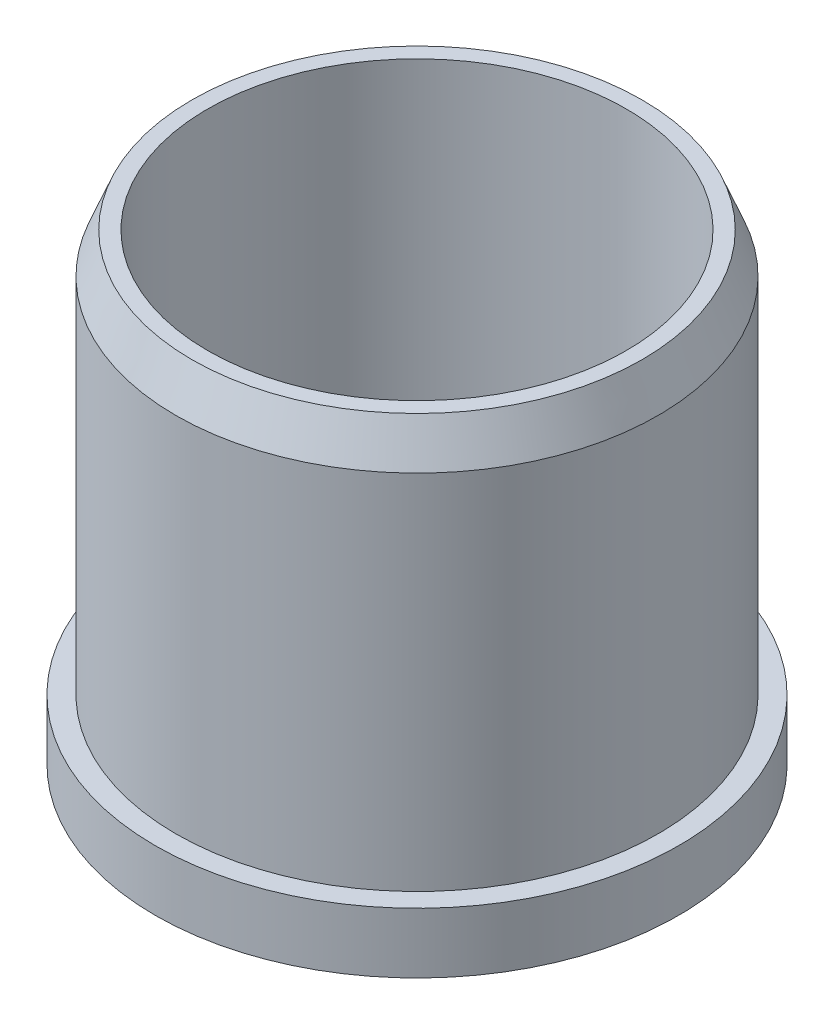
ISO-10303-21;
HEADER;
FILE_DESCRIPTION(('STEP AP214'),'2;1');
FILE_NAME('part.step','',(''),(''),'','','');
FILE_SCHEMA(('AUTOMOTIVE_DESIGN { 1 0 10303 214 1 1 1 1 }'));
ENDSEC;
DATA;
#1=APPLICATION_CONTEXT('core data for automotive mechanical design processes');
#2=APPLICATION_PROTOCOL_DEFINITION('international standard','automotive_design',2000,#1);
#3=PRODUCT_CONTEXT('',#1,'mechanical');
#4=PRODUCT('Part','Part','',(#3));
#5=PRODUCT_RELATED_PRODUCT_CATEGORY('part','',(#4));
#6=PRODUCT_DEFINITION_FORMATION('','',#4);
#7=PRODUCT_DEFINITION_CONTEXT('part definition',#1,'design');
#8=PRODUCT_DEFINITION('design','',#6,#7);
#9=PRODUCT_DEFINITION_SHAPE('','',#8);
#10=(LENGTH_UNIT() NAMED_UNIT(*) SI_UNIT(.MILLI.,.METRE.));
#11=(NAMED_UNIT(*) PLANE_ANGLE_UNIT() SI_UNIT($,.RADIAN.));
#12=(NAMED_UNIT(*) SI_UNIT($,.STERADIAN.) SOLID_ANGLE_UNIT());
#13=UNCERTAINTY_MEASURE_WITH_UNIT(LENGTH_MEASURE(1.E-05),#10,'distance_accuracy_value','');
#14=(GEOMETRIC_REPRESENTATION_CONTEXT(3) GLOBAL_UNCERTAINTY_ASSIGNED_CONTEXT((#13)) GLOBAL_UNIT_ASSIGNED_CONTEXT((#10,
#11,#12)) REPRESENTATION_CONTEXT('',''));
#15=CARTESIAN_POINT('',(0.,0.,0.));
#16=DIRECTION('',(0.,0.,1.));
#17=DIRECTION('',(1.,0.,0.));
#18=AXIS2_PLACEMENT_3D('',#15,#16,#17);
#19=CARTESIAN_POINT('',(0.,9.525,0.));
#20=DIRECTION('',(0.,1.,0.));
#21=DIRECTION('',(0.,0.,1.));
#22=AXIS2_PLACEMENT_3D('',#19,#20,#21);
#23=PLANE('',#22);
#24=CARTESIAN_POINT('',(0.,9.525,0.));
#25=DIRECTION('',(0.,1.,0.));
#26=DIRECTION('',(0.,0.,1.));
#27=AXIS2_PLACEMENT_3D('',#24,#25,#26);
#28=CIRCLE('',#27,12.7);
#29=CARTESIAN_POINT('',(0.,9.525,12.7));
#30=VERTEX_POINT('',#29);
#31=EDGE_CURVE('E107',#30,#30,#28,.T.);
#32=ORIENTED_EDGE('',*,*,#31,.F.);
#33=EDGE_LOOP('',(#32));
#34=FACE_BOUND('',#33,.T.);
#35=CARTESIAN_POINT('',(21.7411519625083,9.525,-7.06412849141284));
#36=DIRECTION('',(0.,1.,0.));
#37=DIRECTION('',(0.,0.,1.));
#38=AXIS2_PLACEMENT_3D('',#35,#36,#37);
#39=CIRCLE('',#38,7.62);
#40=CARTESIAN_POINT('',(21.7411519625083,9.525,0.555871508587157));
#41=VERTEX_POINT('',#40);
#42=EDGE_CURVE('E88',#41,#41,#39,.T.);
#43=ORIENTED_EDGE('',*,*,#42,.F.);
#44=EDGE_LOOP('',(#43));
#45=FACE_BOUND('',#44,.T.);
#46=CARTESIAN_POINT('',(13.4367708674089,9.525,18.4941284914103));
#47=DIRECTION('',(0.,1.,0.));
#48=DIRECTION('',(0.,0.,1.));
#49=AXIS2_PLACEMENT_3D('',#46,#47,#48);
#50=CIRCLE('',#49,7.62);
#51=CARTESIAN_POINT('',(13.4367708674089,9.525,26.1141284914103));
#52=VERTEX_POINT('',#51);
#53=EDGE_CURVE('E91',#52,#52,#50,.T.);
#54=ORIENTED_EDGE('',*,*,#53,.F.);
#55=EDGE_LOOP('',(#54));
#56=FACE_BOUND('',#55,.T.);
#57=CARTESIAN_POINT('',(-13.436770867403,9.525,18.4941284914123));
#58=DIRECTION('',(0.,1.,0.));
#59=DIRECTION('',(0.,0.,1.));
#60=AXIS2_PLACEMENT_3D('',#57,#58,#59);
#61=CIRCLE('',#60,7.62);
#62=CARTESIAN_POINT('',(-13.436770867403,9.525,26.1141284914122));
#63=VERTEX_POINT('',#62);
#64=EDGE_CURVE('E94',#63,#63,#61,.T.);
#65=ORIENTED_EDGE('',*,*,#64,.F.);
#66=EDGE_LOOP('',(#65));
#67=FACE_BOUND('',#66,.T.);
#68=CARTESIAN_POINT('',(-21.7411519625061,9.525,-7.06412849140975));
#69=DIRECTION('',(0.,1.,0.));
#70=DIRECTION('',(0.,0.,1.));
#71=AXIS2_PLACEMENT_3D('',#68,#69,#70);
#72=CIRCLE('',#71,7.62);
#73=CARTESIAN_POINT('',(-21.7411519625061,9.525,0.555871508590244));
#74=VERTEX_POINT('',#73);
#75=EDGE_CURVE('E97',#74,#74,#72,.T.);
#76=ORIENTED_EDGE('',*,*,#75,.F.);
#77=EDGE_LOOP('',(#76));
#78=FACE_BOUND('',#77,.T.);
#79=CARTESIAN_POINT('',(0.,9.525,-22.86));
#80=DIRECTION('',(0.,1.,0.));
#81=DIRECTION('',(0.,0.,1.));
#82=AXIS2_PLACEMENT_3D('',#79,#80,#81);
#83=CIRCLE('',#82,7.62);
#84=CARTESIAN_POINT('',(0.,9.525,-15.24));
#85=VERTEX_POINT('',#84);
#86=EDGE_CURVE('E65',#85,#85,#83,.T.);
#87=ORIENTED_EDGE('',*,*,#86,.F.);
#88=EDGE_LOOP('',(#87));
#89=FACE_BOUND('',#88,.T.);
#90=CARTESIAN_POINT('',(0.,9.525,0.));
#91=DIRECTION('',(0.,1.,0.));
#92=DIRECTION('',(0.,0.,1.));
#93=AXIS2_PLACEMENT_3D('',#90,#91,#92);
#94=CIRCLE('',#93,33.02);
#95=CARTESIAN_POINT('',(0.,9.525,33.02));
#96=VERTEX_POINT('',#95);
#97=EDGE_CURVE('E104',#96,#96,#94,.T.);
#98=ORIENTED_EDGE('',*,*,#97,.T.);
#99=EDGE_LOOP('',(#98));
#100=FACE_BOUND('',#99,.T.);
#101=ADVANCED_FACE('F41',(#34,#45,#56,#67,#78,#89,#100),#23,.T.);
#102=CARTESIAN_POINT('',(0.,9.525,0.));
#103=DIRECTION('',(0.,-1.,0.));
#104=DIRECTION('',(0.,0.,-1.));
#105=AXIS2_PLACEMENT_3D('',#102,#103,#104);
#106=CYLINDRICAL_SURFACE('',#105,41.275);
#107=CARTESIAN_POINT('',(0.,9.525,0.));
#108=DIRECTION('',(0.,1.,0.));
#109=DIRECTION('',(0.,0.,1.));
#110=AXIS2_PLACEMENT_3D('',#107,#108,#109);
#111=CIRCLE('',#110,41.275);
#112=CARTESIAN_POINT('',(0.,9.525,41.275));
#113=VERTEX_POINT('',#112);
#114=EDGE_CURVE('E85',#113,#113,#111,.T.);
#115=ORIENTED_EDGE('',*,*,#114,.F.);
#116=EDGE_LOOP('',(#115));
#117=FACE_BOUND('',#116,.T.);
#118=CARTESIAN_POINT('',(0.,0.,0.));
#119=DIRECTION('',(0.,1.,0.));
#120=DIRECTION('',(0.,0.,1.));
#121=AXIS2_PLACEMENT_3D('',#118,#119,#120);
#122=CIRCLE('',#121,41.275);
#123=CARTESIAN_POINT('',(0.,0.,41.275));
#124=VERTEX_POINT('',#123);
#125=EDGE_CURVE('E66',#124,#124,#122,.T.);
#126=ORIENTED_EDGE('',*,*,#125,.T.);
#127=EDGE_LOOP('',(#126));
#128=FACE_BOUND('',#127,.T.);
#129=ADVANCED_FACE('F131',(#117,#128),#106,.T.);
#130=CARTESIAN_POINT('',(21.7411519625083,9.525,-7.06412849141284));
#131=DIRECTION('',(0.,-1.,0.));
#132=DIRECTION('',(0.,0.,-1.));
#133=AXIS2_PLACEMENT_3D('',#130,#131,#132);
#134=CYLINDRICAL_SURFACE('',#133,7.62);
#135=ORIENTED_EDGE('',*,*,#42,.T.);
#136=EDGE_LOOP('',(#135));
#137=FACE_BOUND('',#136,.T.);
#138=CARTESIAN_POINT('',(21.7411519625083,0.,-7.06412849141284));
#139=DIRECTION('',(0.,1.,0.));
#140=DIRECTION('',(0.,0.,1.));
#141=AXIS2_PLACEMENT_3D('',#138,#139,#140);
#142=CIRCLE('',#141,7.62);
#143=CARTESIAN_POINT('',(21.7411519625083,0.,0.555871508587157));
#144=VERTEX_POINT('',#143);
#145=EDGE_CURVE('E69',#144,#144,#142,.T.);
#146=ORIENTED_EDGE('',*,*,#145,.F.);
#147=EDGE_LOOP('',(#146));
#148=FACE_BOUND('',#147,.T.);
#149=ADVANCED_FACE('F138',(#137,#148),#134,.F.);
#150=CARTESIAN_POINT('',(13.4367708674089,9.525,18.4941284914103));
#151=DIRECTION('',(0.,-1.,0.));
#152=DIRECTION('',(0.,0.,-1.));
#153=AXIS2_PLACEMENT_3D('',#150,#151,#152);
#154=CYLINDRICAL_SURFACE('',#153,7.62);
#155=ORIENTED_EDGE('',*,*,#53,.T.);
#156=EDGE_LOOP('',(#155));
#157=FACE_BOUND('',#156,.T.);
#158=CARTESIAN_POINT('',(13.4367708674089,0.,18.4941284914103));
#159=DIRECTION('',(0.,1.,0.));
#160=DIRECTION('',(0.,0.,1.));
#161=AXIS2_PLACEMENT_3D('',#158,#159,#160);
#162=CIRCLE('',#161,7.62);
#163=CARTESIAN_POINT('',(13.4367708674089,0.,26.1141284914103));
#164=VERTEX_POINT('',#163);
#165=EDGE_CURVE('E72',#164,#164,#162,.T.);
#166=ORIENTED_EDGE('',*,*,#165,.F.);
#167=EDGE_LOOP('',(#166));
#168=FACE_BOUND('',#167,.T.);
#169=ADVANCED_FACE('F225',(#157,#168),#154,.F.);
#170=CARTESIAN_POINT('',(-13.436770867403,9.525,18.4941284914123));
#171=DIRECTION('',(0.,-1.,0.));
#172=DIRECTION('',(0.,0.,-1.));
#173=AXIS2_PLACEMENT_3D('',#170,#171,#172);
#174=CYLINDRICAL_SURFACE('',#173,7.62);
#175=ORIENTED_EDGE('',*,*,#64,.T.);
#176=EDGE_LOOP('',(#175));
#177=FACE_BOUND('',#176,.T.);
#178=CARTESIAN_POINT('',(-13.436770867403,0.,18.4941284914123));
#179=DIRECTION('',(0.,1.,0.));
#180=DIRECTION('',(0.,0.,1.));
#181=AXIS2_PLACEMENT_3D('',#178,#179,#180);
#182=CIRCLE('',#181,7.62);
#183=CARTESIAN_POINT('',(-13.436770867403,0.,26.1141284914122));
#184=VERTEX_POINT('',#183);
#185=EDGE_CURVE('E75',#184,#184,#182,.T.);
#186=ORIENTED_EDGE('',*,*,#185,.F.);
#187=EDGE_LOOP('',(#186));
#188=FACE_BOUND('',#187,.T.);
#189=ADVANCED_FACE('F217',(#177,#188),#174,.F.);
#190=CARTESIAN_POINT('',(-21.7411519625061,9.525,-7.06412849140975));
#191=DIRECTION('',(0.,-1.,0.));
#192=DIRECTION('',(0.,0.,-1.));
#193=AXIS2_PLACEMENT_3D('',#190,#191,#192);
#194=CYLINDRICAL_SURFACE('',#193,7.62);
#195=ORIENTED_EDGE('',*,*,#75,.T.);
#196=EDGE_LOOP('',(#195));
#197=FACE_BOUND('',#196,.T.);
#198=CARTESIAN_POINT('',(-21.7411519625061,0.,-7.06412849140975));
#199=DIRECTION('',(0.,1.,0.));
#200=DIRECTION('',(0.,0.,1.));
#201=AXIS2_PLACEMENT_3D('',#198,#199,#200);
#202=CIRCLE('',#201,7.62);
#203=CARTESIAN_POINT('',(-21.7411519625061,0.,0.555871508590244));
#204=VERTEX_POINT('',#203);
#205=EDGE_CURVE('E78',#204,#204,#202,.T.);
#206=ORIENTED_EDGE('',*,*,#205,.F.);
#207=EDGE_LOOP('',(#206));
#208=FACE_BOUND('',#207,.T.);
#209=ADVANCED_FACE('F208',(#197,#208),#194,.F.);
#210=CARTESIAN_POINT('',(0.,9.525,-22.86));
#211=DIRECTION('',(0.,-1.,0.));
#212=DIRECTION('',(0.,0.,-1.));
#213=AXIS2_PLACEMENT_3D('',#210,#211,#212);
#214=CYLINDRICAL_SURFACE('',#213,7.62);
#215=ORIENTED_EDGE('',*,*,#86,.T.);
#216=EDGE_LOOP('',(#215));
#217=FACE_BOUND('',#216,.T.);
#218=CARTESIAN_POINT('',(0.,0.,-22.86));
#219=DIRECTION('',(0.,1.,0.));
#220=DIRECTION('',(0.,0.,1.));
#221=AXIS2_PLACEMENT_3D('',#218,#219,#220);
#222=CIRCLE('',#221,7.62);
#223=CARTESIAN_POINT('',(0.,0.,-15.24));
#224=VERTEX_POINT('',#223);
#225=EDGE_CURVE('E81',#224,#224,#222,.T.);
#226=ORIENTED_EDGE('',*,*,#225,.F.);
#227=EDGE_LOOP('',(#226));
#228=FACE_BOUND('',#227,.T.);
#229=ADVANCED_FACE('F154',(#217,#228),#214,.F.);
#230=CARTESIAN_POINT('',(0.,9.525,0.));
#231=DIRECTION('',(0.,-1.,0.));
#232=DIRECTION('',(0.,0.,-1.));
#233=AXIS2_PLACEMENT_3D('',#230,#231,#232);
#234=CYLINDRICAL_SURFACE('',#233,6.5024);
#235=CARTESIAN_POINT('',(0.,0.,0.));
#236=DIRECTION('',(0.,1.,0.));
#237=DIRECTION('',(0.,0.,1.));
#238=AXIS2_PLACEMENT_3D('',#235,#236,#237);
#239=CIRCLE('',#238,6.5024);
#240=CARTESIAN_POINT('',(0.,0.,6.5024));
#241=VERTEX_POINT('',#240);
#242=EDGE_CURVE('E62',#241,#241,#239,.T.);
#243=ORIENTED_EDGE('',*,*,#242,.F.);
#244=EDGE_LOOP('',(#243));
#245=FACE_BOUND('',#244,.T.);
#246=CARTESIAN_POINT('',(0.,31.75,0.));
#247=DIRECTION('',(0.,1.,0.));
#248=DIRECTION('',(0.,0.,1.));
#249=AXIS2_PLACEMENT_3D('',#246,#247,#248);
#250=CIRCLE('',#249,6.5024);
#251=CARTESIAN_POINT('',(0.,31.75,6.5024));
#252=VERTEX_POINT('',#251);
#253=EDGE_CURVE('E112',#252,#252,#250,.T.);
#254=ORIENTED_EDGE('',*,*,#253,.T.);
#255=EDGE_LOOP('',(#254));
#256=FACE_BOUND('',#255,.T.);
#257=ADVANCED_FACE('F116',(#245,#256),#234,.F.);
#258=CARTESIAN_POINT('',(0.,9.525,0.));
#259=DIRECTION('',(0.,1.,0.));
#260=DIRECTION('',(0.,0.,1.));
#261=AXIS2_PLACEMENT_3D('',#258,#259,#260);
#262=CIRCLE('',#261,38.0365);
#263=CARTESIAN_POINT('',(0.,9.525,38.0365));
#264=VERTEX_POINT('',#263);
#265=EDGE_CURVE('E61',#264,#264,#262,.T.);
#266=ORIENTED_EDGE('',*,*,#265,.F.);
#267=EDGE_LOOP('',(#266));
#268=FACE_BOUND('',#267,.T.);
#269=ORIENTED_EDGE('',*,*,#114,.T.);
#270=EDGE_LOOP('',(#269));
#271=FACE_BOUND('',#270,.T.);
#272=ADVANCED_FACE('F134',(#268,#271),#23,.T.);
#273=CARTESIAN_POINT('',(0.,0.,0.));
#274=DIRECTION('',(0.,1.,0.));
#275=DIRECTION('',(0.,0.,1.));
#276=AXIS2_PLACEMENT_3D('',#273,#274,#275);
#277=PLANE('',#276);
#278=ORIENTED_EDGE('',*,*,#225,.T.);
#279=EDGE_LOOP('',(#278));
#280=FACE_BOUND('',#279,.T.);
#281=ORIENTED_EDGE('',*,*,#205,.T.);
#282=EDGE_LOOP('',(#281));
#283=FACE_BOUND('',#282,.T.);
#284=ORIENTED_EDGE('',*,*,#185,.T.);
#285=EDGE_LOOP('',(#284));
#286=FACE_BOUND('',#285,.T.);
#287=ORIENTED_EDGE('',*,*,#165,.T.);
#288=EDGE_LOOP('',(#287));
#289=FACE_BOUND('',#288,.T.);
#290=ORIENTED_EDGE('',*,*,#145,.T.);
#291=EDGE_LOOP('',(#290));
#292=FACE_BOUND('',#291,.T.);
#293=ORIENTED_EDGE('',*,*,#125,.F.);
#294=EDGE_LOOP('',(#293));
#295=FACE_BOUND('',#294,.T.);
#296=ORIENTED_EDGE('',*,*,#242,.T.);
#297=EDGE_LOOP('',(#296));
#298=FACE_BOUND('',#297,.T.);
#299=ADVANCED_FACE('F146',(#280,#283,#286,#289,#292,#295,#298),#277,.F.);
#300=CARTESIAN_POINT('',(0.,73.025,0.));
#301=DIRECTION('',(0.,1.,0.));
#302=DIRECTION('',(0.,0.,1.));
#303=AXIS2_PLACEMENT_3D('',#300,#301,#302);
#304=PLANE('',#303);
#305=CARTESIAN_POINT('',(0.,73.025,0.));
#306=DIRECTION('',(0.,1.,0.));
#307=DIRECTION('',(0.,0.,1.));
#308=AXIS2_PLACEMENT_3D('',#305,#306,#307);
#309=CIRCLE('',#308,35.4965);
#310=CARTESIAN_POINT('',(0.,73.025,35.4965));
#311=VERTEX_POINT('',#310);
#312=EDGE_CURVE('E56',#311,#311,#309,.T.);
#313=ORIENTED_EDGE('',*,*,#312,.T.);
#314=EDGE_LOOP('',(#313));
#315=FACE_BOUND('',#314,.T.);
#316=CARTESIAN_POINT('',(0.,73.025,0.));
#317=DIRECTION('',(0.,1.,0.));
#318=DIRECTION('',(0.,0.,1.));
#319=AXIS2_PLACEMENT_3D('',#316,#317,#318);
#320=CIRCLE('',#319,33.02);
#321=CARTESIAN_POINT('',(0.,73.025,33.02));
#322=VERTEX_POINT('',#321);
#323=EDGE_CURVE('E84',#322,#322,#320,.T.);
#324=ORIENTED_EDGE('',*,*,#323,.F.);
#325=EDGE_LOOP('',(#324));
#326=FACE_BOUND('',#325,.T.);
#327=ADVANCED_FACE('F152',(#315,#326),#304,.T.);
#328=CARTESIAN_POINT('',(0.,73.025,0.));
#329=DIRECTION('',(0.,-1.,0.));
#330=DIRECTION('',(0.,0.,-1.));
#331=AXIS2_PLACEMENT_3D('',#328,#329,#330);
#332=CYLINDRICAL_SURFACE('',#331,38.0365);
#333=CARTESIAN_POINT('',(0.,66.675,0.));
#334=DIRECTION('',(0.,1.,0.));
#335=DIRECTION('',(0.,0.,1.));
#336=AXIS2_PLACEMENT_3D('',#333,#334,#335);
#337=CIRCLE('',#336,38.0365);
#338=CARTESIAN_POINT('',(0.,66.675,38.0365));
#339=VERTEX_POINT('',#338);
#340=EDGE_CURVE('E52',#339,#339,#337,.F.);
#341=ORIENTED_EDGE('',*,*,#340,.T.);
#342=EDGE_LOOP('',(#341));
#343=FACE_BOUND('',#342,.T.);
#344=ORIENTED_EDGE('',*,*,#265,.T.);
#345=EDGE_LOOP('',(#344));
#346=FACE_BOUND('',#345,.T.);
#347=ADVANCED_FACE('F166',(#343,#346),#332,.T.);
#348=CARTESIAN_POINT('',(0.,73.025,0.));
#349=DIRECTION('',(0.,-1.,0.));
#350=DIRECTION('',(0.,0.,-1.));
#351=AXIS2_PLACEMENT_3D('',#348,#349,#350);
#352=CYLINDRICAL_SURFACE('',#351,33.02);
#353=ORIENTED_EDGE('',*,*,#323,.T.);
#354=EDGE_LOOP('',(#353));
#355=FACE_BOUND('',#354,.T.);
#356=ORIENTED_EDGE('',*,*,#97,.F.);
#357=EDGE_LOOP('',(#356));
#358=FACE_BOUND('',#357,.T.);
#359=ADVANCED_FACE('F168',(#355,#358),#352,.F.);
#360=CARTESIAN_POINT('',(0.,25.4,0.));
#361=DIRECTION('',(0.,-1.,0.));
#362=DIRECTION('',(0.,0.,-1.));
#363=AXIS2_PLACEMENT_3D('',#360,#361,#362);
#364=CYLINDRICAL_SURFACE('',#363,12.7);
#365=CARTESIAN_POINT('',(0.,29.21,0.));
#366=DIRECTION('',(0.,1.,0.));
#367=DIRECTION('',(0.,0.,1.));
#368=AXIS2_PLACEMENT_3D('',#365,#366,#367);
#369=CIRCLE('',#368,12.7);
#370=CARTESIAN_POINT('',(0.,29.21,12.7));
#371=VERTEX_POINT('',#370);
#372=EDGE_CURVE('E10',#371,#371,#369,.F.);
#373=ORIENTED_EDGE('',*,*,#372,.T.);
#374=EDGE_LOOP('',(#373));
#375=FACE_BOUND('',#374,.T.);
#376=ORIENTED_EDGE('',*,*,#31,.T.);
#377=EDGE_LOOP('',(#376));
#378=FACE_BOUND('',#377,.T.);
#379=ADVANCED_FACE('F127',(#375,#378),#364,.T.);
#380=CARTESIAN_POINT('',(0.,73.025,0.));
#381=DIRECTION('',(0.,-1.,0.));
#382=DIRECTION('',(0.,0.,-1.));
#383=AXIS2_PLACEMENT_3D('',#380,#381,#382);
#384=CONICAL_SURFACE('',#383,35.4965,0.380506377112362);
#385=ORIENTED_EDGE('',*,*,#340,.F.);
#386=EDGE_LOOP('',(#385));
#387=FACE_BOUND('',#386,.T.);
#388=ORIENTED_EDGE('',*,*,#312,.F.);
#389=EDGE_LOOP('',(#388));
#390=FACE_BOUND('',#389,.T.);
#391=ADVANCED_FACE('F120',(#387,#390),#384,.T.);
#392=CARTESIAN_POINT('',(0.,31.75,0.));
#393=DIRECTION('',(0.,1.,0.));
#394=DIRECTION('',(0.,0.,1.));
#395=AXIS2_PLACEMENT_3D('',#392,#393,#394);
#396=PLANE('',#395);
#397=CARTESIAN_POINT('',(0.,31.75,0.));
#398=DIRECTION('',(0.,1.,0.));
#399=DIRECTION('',(0.,0.,1.));
#400=AXIS2_PLACEMENT_3D('',#397,#398,#399);
#401=CIRCLE('',#400,10.16);
#402=CARTESIAN_POINT('',(0.,31.75,10.16));
#403=VERTEX_POINT('',#402);
#404=EDGE_CURVE('E48',#403,#403,#401,.T.);
#405=ORIENTED_EDGE('',*,*,#404,.T.);
#406=EDGE_LOOP('',(#405));
#407=FACE_BOUND('',#406,.T.);
#408=ORIENTED_EDGE('',*,*,#253,.F.);
#409=EDGE_LOOP('',(#408));
#410=FACE_BOUND('',#409,.T.);
#411=ADVANCED_FACE('F118',(#407,#410),#396,.T.);
#412=CARTESIAN_POINT('',(0.,29.21,0.));
#413=DIRECTION('',(0.,1.,0.));
#414=DIRECTION('',(0.,0.,1.));
#415=AXIS2_PLACEMENT_3D('',#412,#413,#414);
#416=TOROIDAL_SURFACE('',#415,10.16,2.54);
#417=ORIENTED_EDGE('',*,*,#372,.F.);
#418=EDGE_LOOP('',(#417));
#419=FACE_BOUND('',#418,.T.);
#420=ORIENTED_EDGE('',*,*,#404,.F.);
#421=EDGE_LOOP('',(#420));
#422=FACE_BOUND('',#421,.T.);
#423=ADVANCED_FACE('F43',(#419,#422),#416,.T.);
#424=CLOSED_SHELL('',(#101,#129,#149,#169,#189,#209,#229,#257,#272,#299,#327,#347,#359,#379,
#391,#411,#423));
#425=MANIFOLD_SOLID_BREP('B2',#424);
#426=ADVANCED_BREP_SHAPE_REPRESENTATION('',(#18,#425),#14);
#427=SHAPE_DEFINITION_REPRESENTATION(#9,#426);
ENDSEC;
END-ISO-10303-21;
